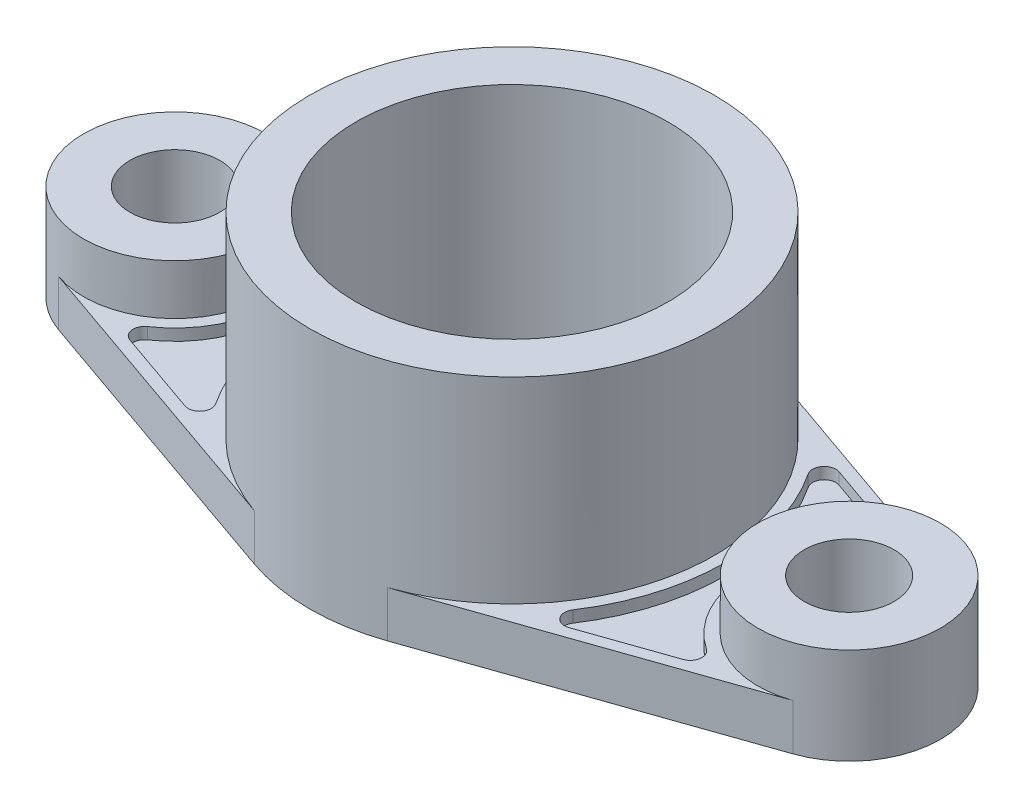
ISO-10303-21;
HEADER;
FILE_DESCRIPTION(('STEP AP214'),'2;1');
FILE_NAME('part.step','',(''),(''),'','','');
FILE_SCHEMA(('AUTOMOTIVE_DESIGN { 1 0 10303 214 1 1 1 1 }'));
ENDSEC;
DATA;
#1=APPLICATION_CONTEXT('core data for automotive mechanical design processes');
#2=APPLICATION_PROTOCOL_DEFINITION('international standard','automotive_design',2000,#1);
#3=PRODUCT_CONTEXT('',#1,'mechanical');
#4=PRODUCT('Part','Part','',(#3));
#5=PRODUCT_RELATED_PRODUCT_CATEGORY('part','',(#4));
#6=PRODUCT_DEFINITION_FORMATION('','',#4);
#7=PRODUCT_DEFINITION_CONTEXT('part definition',#1,'design');
#8=PRODUCT_DEFINITION('design','',#6,#7);
#9=PRODUCT_DEFINITION_SHAPE('','',#8);
#10=(LENGTH_UNIT() NAMED_UNIT(*) SI_UNIT(.MILLI.,.METRE.));
#11=(NAMED_UNIT(*) PLANE_ANGLE_UNIT() SI_UNIT($,.RADIAN.));
#12=(NAMED_UNIT(*) SI_UNIT($,.STERADIAN.) SOLID_ANGLE_UNIT());
#13=UNCERTAINTY_MEASURE_WITH_UNIT(LENGTH_MEASURE(1.E-05),#10,'distance_accuracy_value','');
#14=(GEOMETRIC_REPRESENTATION_CONTEXT(3) GLOBAL_UNCERTAINTY_ASSIGNED_CONTEXT((#13)) GLOBAL_UNIT_ASSIGNED_CONTEXT((#10,
#11,#12)) REPRESENTATION_CONTEXT('',''));
#15=CARTESIAN_POINT('',(0.,0.,0.));
#16=DIRECTION('',(0.,0.,1.));
#17=DIRECTION('',(1.,0.,0.));
#18=AXIS2_PLACEMENT_3D('',#15,#16,#17);
#19=CARTESIAN_POINT('',(16.3123714285714,12.,46.734960558198));
#20=DIRECTION('',(-0.329542857142857,0.,-0.944140617337334));
#21=DIRECTION('',(-0.944140617337334,0.,0.329542857142857));
#22=AXIS2_PLACEMENT_3D('',#19,#20,#21);
#23=PLANE('',#22);
#24=DIRECTION('',(0.944140617337334,0.,-0.329542857142857));
#25=VECTOR('',#24,1.);
#26=CARTESIAN_POINT('',(16.3123714285714,9.,46.734960558198));
#27=LINE('',#26,#25);
#28=CARTESIAN_POINT('',(49.826038740367,9.,35.0373495493516));
#29=VERTEX_POINT('',#28);
#30=CARTESIAN_POINT('',(71.8093276206941,9.,27.3643020244494));
#31=VERTEX_POINT('',#30);
#32=EDGE_CURVE('E355',#29,#31,#27,.T.);
#33=ORIENTED_EDGE('',*,*,#32,.F.);
#34=DIRECTION('',(0.,-1.,0.));
#35=VECTOR('',#34,1.);
#36=CARTESIAN_POINT('',(49.826038740367,12.,35.0373495493516));
#37=LINE('',#36,#35);
#38=CARTESIAN_POINT('',(49.826038740367,12.,35.0373495493516));
#39=VERTEX_POINT('',#38);
#40=EDGE_CURVE('E11',#39,#29,#37,.T.);
#41=ORIENTED_EDGE('',*,*,#40,.F.);
#42=DIRECTION('',(0.944140617337334,0.,-0.329542857142857));
#43=VECTOR('',#42,1.);
#44=CARTESIAN_POINT('',(16.3123714285714,12.,46.734960558198));
#45=LINE('',#44,#43);
#46=CARTESIAN_POINT('',(71.8093276206941,12.,27.3643020244494));
#47=VERTEX_POINT('',#46);
#48=EDGE_CURVE('E396',#39,#47,#45,.T.);
#49=ORIENTED_EDGE('',*,*,#48,.T.);
#50=DIRECTION('',(0.,-1.,0.));
#51=VECTOR('',#50,1.);
#52=CARTESIAN_POINT('',(71.8093276206941,12.,27.3643020244494));
#53=LINE('',#52,#51);
#54=EDGE_CURVE('E433',#47,#31,#53,.T.);
#55=ORIENTED_EDGE('',*,*,#54,.T.);
#56=EDGE_LOOP('',(#33,#41,#49,#55));
#57=FACE_BOUND('',#56,.T.);
#58=ADVANCED_FACE('F45',(#57),#23,.T.);
#59=CARTESIAN_POINT('',(48.8374101689384,12.,32.2049276973396));
#60=DIRECTION('',(0.,-1.,0.));
#61=DIRECTION('',(0.,0.,-1.));
#62=AXIS2_PLACEMENT_3D('',#59,#60,#61);
#63=CYLINDRICAL_SURFACE('',#62,3.);
#64=ORIENTED_EDGE('',*,*,#40,.T.);
#65=CARTESIAN_POINT('',(48.8374101689384,9.,32.2049276973396));
#66=DIRECTION('',(0.,1.,0.));
#67=DIRECTION('',(0.,0.,1.));
#68=AXIS2_PLACEMENT_3D('',#65,#66,#67);
#69=CIRCLE('',#68,3.);
#70=CARTESIAN_POINT('',(46.3329275961724,9.,30.5533929436299));
#71=VERTEX_POINT('',#70);
#72=EDGE_CURVE('E346',#29,#71,#69,.F.);
#73=ORIENTED_EDGE('',*,*,#72,.T.);
#74=DIRECTION('',(0.,-1.,0.));
#75=VECTOR('',#74,1.);
#76=CARTESIAN_POINT('',(46.3329275961724,12.,30.5533929436299));
#77=LINE('',#76,#75);
#78=CARTESIAN_POINT('',(46.3329275961724,12.,30.5533929436299));
#79=VERTEX_POINT('',#78);
#80=EDGE_CURVE('E55',#79,#71,#77,.T.);
#81=ORIENTED_EDGE('',*,*,#80,.F.);
#82=CARTESIAN_POINT('',(48.8374101689384,12.,32.2049276973396));
#83=DIRECTION('',(0.,1.,0.));
#84=DIRECTION('',(0.,0.,1.));
#85=AXIS2_PLACEMENT_3D('',#82,#83,#84);
#86=CIRCLE('',#85,3.);
#87=EDGE_CURVE('E400',#39,#79,#86,.F.);
#88=ORIENTED_EDGE('',*,*,#87,.F.);
#89=EDGE_LOOP('',(#64,#73,#81,#88));
#90=FACE_BOUND('',#89,.T.);
#91=ADVANCED_FACE('F582',(#90),#63,.F.);
#92=CARTESIAN_POINT('',(0.,12.,0.));
#93=DIRECTION('',(0.,-1.,0.));
#94=DIRECTION('',(0.,0.,-1.));
#95=AXIS2_PLACEMENT_3D('',#92,#93,#94);
#96=CYLINDRICAL_SURFACE('',#95,55.5);
#97=ORIENTED_EDGE('',*,*,#80,.T.);
#98=CARTESIAN_POINT('',(0.,9.,0.));
#99=DIRECTION('',(0.,1.,0.));
#100=DIRECTION('',(0.,0.,1.));
#101=AXIS2_PLACEMENT_3D('',#98,#99,#100);
#102=CIRCLE('',#101,55.5);
#103=CARTESIAN_POINT('',(46.3329275961724,9.,-30.5533929436299));
#104=VERTEX_POINT('',#103);
#105=EDGE_CURVE('E377',#71,#104,#102,.T.);
#106=ORIENTED_EDGE('',*,*,#105,.T.);
#107=DIRECTION('',(0.,-1.,0.));
#108=VECTOR('',#107,1.);
#109=CARTESIAN_POINT('',(46.3329275961724,12.,-30.5533929436299));
#110=LINE('',#109,#108);
#111=CARTESIAN_POINT('',(46.3329275961724,12.,-30.5533929436299));
#112=VERTEX_POINT('',#111);
#113=EDGE_CURVE('E452',#112,#104,#110,.T.);
#114=ORIENTED_EDGE('',*,*,#113,.F.);
#115=CARTESIAN_POINT('',(0.,12.,0.));
#116=DIRECTION('',(0.,1.,0.));
#117=DIRECTION('',(0.,0.,1.));
#118=AXIS2_PLACEMENT_3D('',#115,#116,#117);
#119=CIRCLE('',#118,55.5);
#120=EDGE_CURVE('E404',#79,#112,#119,.T.);
#121=ORIENTED_EDGE('',*,*,#120,.F.);
#122=EDGE_LOOP('',(#97,#106,#114,#121));
#123=FACE_BOUND('',#122,.T.);
#124=ADVANCED_FACE('F588',(#123),#96,.T.);
#125=CARTESIAN_POINT('',(48.8374101689384,12.,-32.2049276973396));
#126=DIRECTION('',(0.,-1.,0.));
#127=DIRECTION('',(0.,0.,-1.));
#128=AXIS2_PLACEMENT_3D('',#125,#126,#127);
#129=CYLINDRICAL_SURFACE('',#128,3.);
#130=ORIENTED_EDGE('',*,*,#113,.T.);
#131=CARTESIAN_POINT('',(48.8374101689384,9.,-32.2049276973396));
#132=DIRECTION('',(0.,1.,0.));
#133=DIRECTION('',(0.,0.,1.));
#134=AXIS2_PLACEMENT_3D('',#131,#132,#133);
#135=CIRCLE('',#134,3.);
#136=CARTESIAN_POINT('',(49.826038740367,9.,-35.0373495493516));
#137=VERTEX_POINT('',#136);
#138=EDGE_CURVE('E374',#104,#137,#135,.F.);
#139=ORIENTED_EDGE('',*,*,#138,.T.);
#140=DIRECTION('',(0.,-1.,0.));
#141=VECTOR('',#140,1.);
#142=CARTESIAN_POINT('',(49.826038740367,12.,-35.0373495493516));
#143=LINE('',#142,#141);
#144=CARTESIAN_POINT('',(49.826038740367,12.,-35.0373495493516));
#145=VERTEX_POINT('',#144);
#146=EDGE_CURVE('E448',#145,#137,#143,.T.);
#147=ORIENTED_EDGE('',*,*,#146,.F.);
#148=CARTESIAN_POINT('',(48.8374101689384,12.,-32.2049276973396));
#149=DIRECTION('',(0.,1.,0.));
#150=DIRECTION('',(0.,0.,1.));
#151=AXIS2_PLACEMENT_3D('',#148,#149,#150);
#152=CIRCLE('',#151,3.);
#153=EDGE_CURVE('E408',#112,#145,#152,.F.);
#154=ORIENTED_EDGE('',*,*,#153,.F.);
#155=EDGE_LOOP('',(#130,#139,#147,#154));
#156=FACE_BOUND('',#155,.T.);
#157=ADVANCED_FACE('F911',(#156),#129,.F.);
#158=CARTESIAN_POINT('',(16.3123714285715,12.,-46.7349605581981));
#159=DIRECTION('',(0.329542857142858,0.,-0.944140617337334));
#160=DIRECTION('',(-0.944140617337334,0.,-0.329542857142858));
#161=AXIS2_PLACEMENT_3D('',#158,#159,#160);
#162=PLANE('',#161);
#163=ORIENTED_EDGE('',*,*,#146,.T.);
#164=DIRECTION('',(0.944140617337334,0.,0.329542857142858));
#165=VECTOR('',#164,1.);
#166=CARTESIAN_POINT('',(16.3123714285715,9.,-46.7349605581981));
#167=LINE('',#166,#165);
#168=CARTESIAN_POINT('',(71.8093276206941,9.,-27.3643020244494));
#169=VERTEX_POINT('',#168);
#170=EDGE_CURVE('E371',#137,#169,#167,.T.);
#171=ORIENTED_EDGE('',*,*,#170,.T.);
#172=DIRECTION('',(0.,-1.,0.));
#173=VECTOR('',#172,1.);
#174=CARTESIAN_POINT('',(71.8093276206941,12.,-27.3643020244494));
#175=LINE('',#174,#173);
#176=CARTESIAN_POINT('',(71.8093276206941,12.,-27.3643020244494));
#177=VERTEX_POINT('',#176);
#178=EDGE_CURVE('E444',#177,#169,#175,.T.);
#179=ORIENTED_EDGE('',*,*,#178,.F.);
#180=DIRECTION('',(0.944140617337334,0.,0.329542857142858));
#181=VECTOR('',#180,1.);
#182=CARTESIAN_POINT('',(16.3123714285715,12.,-46.7349605581981));
#183=LINE('',#182,#181);
#184=EDGE_CURVE('E412',#145,#177,#183,.T.);
#185=ORIENTED_EDGE('',*,*,#184,.F.);
#186=EDGE_LOOP('',(#163,#171,#179,#185));
#187=FACE_BOUND('',#186,.T.);
#188=ADVANCED_FACE('F900',(#187),#162,.F.);
#189=CARTESIAN_POINT('',(70.8206990492656,12.,-24.5318801724374));
#190=DIRECTION('',(0.,-1.,0.));
#191=DIRECTION('',(0.,0.,-1.));
#192=AXIS2_PLACEMENT_3D('',#189,#190,#191);
#193=CYLINDRICAL_SURFACE('',#192,3.);
#194=CARTESIAN_POINT('',(70.8206990492656,9.,-24.5318801724374));
#195=DIRECTION('',(0.,1.,0.));
#196=DIRECTION('',(0.,0.,1.));
#197=AXIS2_PLACEMENT_3D('',#194,#195,#196);
#198=CIRCLE('',#197,3.);
#199=CARTESIAN_POINT('',(72.507464694039,9.,-22.0509888689717));
#200=VERTEX_POINT('',#199);
#201=EDGE_CURVE('E367',#200,#169,#198,.T.);
#202=ORIENTED_EDGE('',*,*,#201,.F.);
#203=DIRECTION('',(0.,-1.,0.));
#204=VECTOR('',#203,1.);
#205=CARTESIAN_POINT('',(72.507464694039,12.,-22.0509888689717));
#206=LINE('',#205,#204);
#207=CARTESIAN_POINT('',(72.507464694039,12.,-22.0509888689717));
#208=VERTEX_POINT('',#207);
#209=EDGE_CURVE('E440',#208,#200,#206,.T.);
#210=ORIENTED_EDGE('',*,*,#209,.F.);
#211=CARTESIAN_POINT('',(70.8206990492656,12.,-24.5318801724374));
#212=DIRECTION('',(0.,1.,0.));
#213=DIRECTION('',(0.,0.,1.));
#214=AXIS2_PLACEMENT_3D('',#211,#212,#213);
#215=CIRCLE('',#214,3.);
#216=EDGE_CURVE('E415',#208,#177,#215,.T.);
#217=ORIENTED_EDGE('',*,*,#216,.T.);
#218=ORIENTED_EDGE('',*,*,#178,.T.);
#219=EDGE_LOOP('',(#202,#210,#217,#218));
#220=FACE_BOUND('',#219,.T.);
#221=ADVANCED_FACE('F888',(#220),#193,.F.);
#222=CARTESIAN_POINT('',(87.5,12.,0.));
#223=DIRECTION('',(0.,-1.,0.));
#224=DIRECTION('',(0.,0.,-1.));
#225=AXIS2_PLACEMENT_3D('',#222,#223,#224);
#226=CYLINDRICAL_SURFACE('',#225,26.665);
#227=ORIENTED_EDGE('',*,*,#209,.T.);
#228=CARTESIAN_POINT('',(87.5,9.,0.));
#229=DIRECTION('',(0.,1.,0.));
#230=DIRECTION('',(0.,0.,1.));
#231=AXIS2_PLACEMENT_3D('',#228,#229,#230);
#232=CIRCLE('',#231,26.665);
#233=CARTESIAN_POINT('',(72.507464694039,9.,22.0509888689717));
#234=VERTEX_POINT('',#233);
#235=EDGE_CURVE('E363',#200,#234,#232,.T.);
#236=ORIENTED_EDGE('',*,*,#235,.T.);
#237=DIRECTION('',(0.,-1.,0.));
#238=VECTOR('',#237,1.);
#239=CARTESIAN_POINT('',(72.507464694039,12.,22.0509888689717));
#240=LINE('',#239,#238);
#241=CARTESIAN_POINT('',(72.507464694039,12.,22.0509888689717));
#242=VERTEX_POINT('',#241);
#243=EDGE_CURVE('E437',#242,#234,#240,.T.);
#244=ORIENTED_EDGE('',*,*,#243,.F.);
#245=CARTESIAN_POINT('',(87.5,12.,0.));
#246=DIRECTION('',(0.,1.,0.));
#247=DIRECTION('',(0.,0.,1.));
#248=AXIS2_PLACEMENT_3D('',#245,#246,#247);
#249=CIRCLE('',#248,26.665);
#250=EDGE_CURVE('E419',#208,#242,#249,.T.);
#251=ORIENTED_EDGE('',*,*,#250,.F.);
#252=EDGE_LOOP('',(#227,#236,#244,#251));
#253=FACE_BOUND('',#252,.T.);
#254=ADVANCED_FACE('F603',(#253),#226,.T.);
#255=CARTESIAN_POINT('',(17.301,12.,-49.56738241021));
#256=DIRECTION('',(0.329542857142857,0.,-0.944140617337334));
#257=DIRECTION('',(-0.944140617337334,0.,-0.329542857142857));
#258=AXIS2_PLACEMENT_3D('',#255,#256,#257);
#259=PLANE('',#258);
#260=DIRECTION('',(0.944140617337334,0.,0.329542857142857));
#261=VECTOR('',#260,1.);
#262=CARTESIAN_POINT('',(17.301,0.,-49.56738241021));
#263=LINE('',#262,#261);
#264=CARTESIAN_POINT('',(17.301,0.,-49.56738241021));
#265=VERTEX_POINT('',#264);
#266=CARTESIAN_POINT('',(95.2986317142857,0.,-22.343087709288));
#267=VERTEX_POINT('',#266);
#268=EDGE_CURVE('E380',#265,#267,#263,.T.);
#269=ORIENTED_EDGE('',*,*,#268,.F.);
#270=DIRECTION('',(0.,-1.,0.));
#271=VECTOR('',#270,1.);
#272=CARTESIAN_POINT('',(17.301,12.,-49.56738241021));
#273=LINE('',#272,#271);
#274=CARTESIAN_POINT('',(17.301,12.,-49.56738241021));
#275=VERTEX_POINT('',#274);
#276=EDGE_CURVE('E465',#275,#265,#273,.T.);
#277=ORIENTED_EDGE('',*,*,#276,.F.);
#278=DIRECTION('',(0.944140617337334,0.,0.329542857142857));
#279=VECTOR('',#278,1.);
#280=CARTESIAN_POINT('',(17.301,12.,-49.56738241021));
#281=LINE('',#280,#279);
#282=CARTESIAN_POINT('',(95.2986317142857,12.,-22.343087709288));
#283=VERTEX_POINT('',#282);
#284=EDGE_CURVE('E384',#275,#283,#281,.T.);
#285=ORIENTED_EDGE('',*,*,#284,.T.);
#286=DIRECTION('',(0.,-1.,0.));
#287=VECTOR('',#286,1.);
#288=CARTESIAN_POINT('',(95.2986317142857,12.,-22.343087709288));
#289=LINE('',#288,#287);
#290=EDGE_CURVE('E49',#283,#267,#289,.T.);
#291=ORIENTED_EDGE('',*,*,#290,.T.);
#292=EDGE_LOOP('',(#269,#277,#285,#291));
#293=FACE_BOUND('',#292,.T.);
#294=ADVANCED_FACE('F47',(#293),#259,.T.);
#295=CARTESIAN_POINT('',(17.301,12.,49.5673824102101));
#296=DIRECTION('',(0.329542857142857,0.,0.944140617337334));
#297=DIRECTION('',(0.944140617337334,0.,-0.329542857142857));
#298=AXIS2_PLACEMENT_3D('',#295,#296,#297);
#299=PLANE('',#298);
#300=DIRECTION('',(-0.944140617337334,0.,0.329542857142857));
#301=VECTOR('',#300,1.);
#302=CARTESIAN_POINT('',(17.301,0.,49.5673824102101));
#303=LINE('',#302,#301);
#304=CARTESIAN_POINT('',(95.2986317142857,0.,22.343087709288));
#305=VERTEX_POINT('',#304);
#306=CARTESIAN_POINT('',(17.301,0.,49.56738241021));
#307=VERTEX_POINT('',#306);
#308=EDGE_CURVE('E385',#305,#307,#303,.T.);
#309=ORIENTED_EDGE('',*,*,#308,.F.);
#310=DIRECTION('',(0.,-1.,0.));
#311=VECTOR('',#310,1.);
#312=CARTESIAN_POINT('',(95.2986317142857,12.,22.343087709288));
#313=LINE('',#312,#311);
#314=CARTESIAN_POINT('',(95.2986317142857,12.,22.343087709288));
#315=VERTEX_POINT('',#314);
#316=EDGE_CURVE('E426',#315,#305,#313,.T.);
#317=ORIENTED_EDGE('',*,*,#316,.F.);
#318=DIRECTION('',(-0.944140617337334,0.,0.329542857142857));
#319=VECTOR('',#318,1.);
#320=CARTESIAN_POINT('',(17.301,12.,49.5673824102101));
#321=LINE('',#320,#319);
#322=CARTESIAN_POINT('',(17.301,12.,49.56738241021));
#323=VERTEX_POINT('',#322);
#324=EDGE_CURVE('E392',#315,#323,#321,.T.);
#325=ORIENTED_EDGE('',*,*,#324,.T.);
#326=DIRECTION('',(0.,-1.,0.));
#327=VECTOR('',#326,1.);
#328=CARTESIAN_POINT('',(17.301,12.,49.5673824102101));
#329=LINE('',#328,#327);
#330=EDGE_CURVE('E462',#323,#307,#329,.T.);
#331=ORIENTED_EDGE('',*,*,#330,.T.);
#332=EDGE_LOOP('',(#309,#317,#325,#331));
#333=FACE_BOUND('',#332,.T.);
#334=ADVANCED_FACE('F592',(#333),#299,.T.);
#335=CARTESIAN_POINT('',(70.8206990492656,12.,24.5318801724374));
#336=DIRECTION('',(0.,-1.,0.));
#337=DIRECTION('',(0.,0.,-1.));
#338=AXIS2_PLACEMENT_3D('',#335,#336,#337);
#339=CYLINDRICAL_SURFACE('',#338,3.);
#340=CARTESIAN_POINT('',(70.8206990492656,9.,24.5318801724374));
#341=DIRECTION('',(0.,1.,0.));
#342=DIRECTION('',(0.,0.,1.));
#343=AXIS2_PLACEMENT_3D('',#340,#341,#342);
#344=CIRCLE('',#343,3.);
#345=EDGE_CURVE('E359',#31,#234,#344,.T.);
#346=ORIENTED_EDGE('',*,*,#345,.F.);
#347=ORIENTED_EDGE('',*,*,#54,.F.);
#348=CARTESIAN_POINT('',(70.8206990492656,12.,24.5318801724374));
#349=DIRECTION('',(0.,1.,0.));
#350=DIRECTION('',(0.,0.,1.));
#351=AXIS2_PLACEMENT_3D('',#348,#349,#350);
#352=CIRCLE('',#351,3.);
#353=EDGE_CURVE('E422',#47,#242,#352,.T.);
#354=ORIENTED_EDGE('',*,*,#353,.T.);
#355=ORIENTED_EDGE('',*,*,#243,.T.);
#356=EDGE_LOOP('',(#346,#347,#354,#355));
#357=FACE_BOUND('',#356,.T.);
#358=ADVANCED_FACE('F594',(#357),#339,.F.);
#359=CARTESIAN_POINT('',(0.,12.,0.));
#360=DIRECTION('',(0.,1.,0.));
#361=DIRECTION('',(0.,0.,1.));
#362=AXIS2_PLACEMENT_3D('',#359,#360,#361);
#363=PLANE('',#362);
#364=CARTESIAN_POINT('',(87.5,12.,0.));
#365=DIRECTION('',(0.,1.,0.));
#366=DIRECTION('',(0.,0.,1.));
#367=AXIS2_PLACEMENT_3D('',#364,#365,#366);
#368=CIRCLE('',#367,23.665);
#369=EDGE_CURVE('E381',#283,#315,#368,.T.);
#370=ORIENTED_EDGE('',*,*,#369,.F.);
#371=ORIENTED_EDGE('',*,*,#284,.F.);
#372=CARTESIAN_POINT('',(0.,12.,0.));
#373=DIRECTION('',(0.,1.,0.));
#374=DIRECTION('',(0.,0.,1.));
#375=AXIS2_PLACEMENT_3D('',#372,#373,#374);
#376=CIRCLE('',#375,52.5);
#377=EDGE_CURVE('E389',#323,#275,#376,.T.);
#378=ORIENTED_EDGE('',*,*,#377,.F.);
#379=ORIENTED_EDGE('',*,*,#324,.F.);
#380=EDGE_LOOP('',(#370,#371,#378,#379));
#381=FACE_BOUND('',#380,.T.);
#382=ORIENTED_EDGE('',*,*,#48,.F.);
#383=ORIENTED_EDGE('',*,*,#87,.T.);
#384=ORIENTED_EDGE('',*,*,#120,.T.);
#385=ORIENTED_EDGE('',*,*,#153,.T.);
#386=ORIENTED_EDGE('',*,*,#184,.T.);
#387=ORIENTED_EDGE('',*,*,#216,.F.);
#388=ORIENTED_EDGE('',*,*,#250,.T.);
#389=ORIENTED_EDGE('',*,*,#353,.F.);
#390=EDGE_LOOP('',(#382,#383,#384,#385,#386,#387,#388,#389));
#391=FACE_BOUND('',#390,.T.);
#392=ADVANCED_FACE('F600',(#381,#391),#363,.T.);
#393=CARTESIAN_POINT('',(0.,0.,0.));
#394=DIRECTION('',(0.,1.,0.));
#395=DIRECTION('',(0.,0.,1.));
#396=AXIS2_PLACEMENT_3D('',#393,#394,#395);
#397=PLANE('',#396);
#398=ORIENTED_EDGE('',*,*,#268,.T.);
#399=CARTESIAN_POINT('',(87.5,0.,0.));
#400=DIRECTION('',(0.,1.,0.));
#401=DIRECTION('',(0.,0.,1.));
#402=AXIS2_PLACEMENT_3D('',#399,#400,#401);
#403=CIRCLE('',#402,23.665);
#404=EDGE_CURVE('E479',#305,#267,#403,.T.);
#405=ORIENTED_EDGE('',*,*,#404,.F.);
#406=ORIENTED_EDGE('',*,*,#308,.T.);
#407=CARTESIAN_POINT('',(0.,0.,0.));
#408=DIRECTION('',(0.,1.,0.));
#409=DIRECTION('',(0.,0.,1.));
#410=AXIS2_PLACEMENT_3D('',#407,#408,#409);
#411=CIRCLE('',#410,52.5);
#412=CARTESIAN_POINT('',(-17.301,0.,49.5673824102101));
#413=VERTEX_POINT('',#412);
#414=EDGE_CURVE('E350',#413,#307,#411,.T.);
#415=ORIENTED_EDGE('',*,*,#414,.F.);
#416=DIRECTION('',(0.944140617337334,0.,0.329542857142857));
#417=VECTOR('',#416,1.);
#418=CARTESIAN_POINT('',(-17.301,0.,49.5673824102101));
#419=LINE('',#418,#417);
#420=CARTESIAN_POINT('',(-95.2986317142857,0.,22.343087709288));
#421=VERTEX_POINT('',#420);
#422=EDGE_CURVE('E256',#421,#413,#419,.T.);
#423=ORIENTED_EDGE('',*,*,#422,.F.);
#424=CARTESIAN_POINT('',(-87.5,0.,0.));
#425=DIRECTION('',(0.,1.,0.));
#426=DIRECTION('',(0.,0.,1.));
#427=AXIS2_PLACEMENT_3D('',#424,#425,#426);
#428=CIRCLE('',#427,23.665);
#429=CARTESIAN_POINT('',(-95.2986317142857,0.,-22.343087709288));
#430=VERTEX_POINT('',#429);
#431=EDGE_CURVE('E486',#430,#421,#428,.T.);
#432=ORIENTED_EDGE('',*,*,#431,.F.);
#433=DIRECTION('',(0.944140617337334,0.,-0.329542857142857));
#434=VECTOR('',#433,1.);
#435=CARTESIAN_POINT('',(-17.301,0.,-49.5673824102101));
#436=LINE('',#435,#434);
#437=CARTESIAN_POINT('',(-37.6097890840281,0.,-42.4788023227049));
#438=VERTEX_POINT('',#437);
#439=EDGE_CURVE('E231',#430,#438,#436,.T.);
#440=ORIENTED_EDGE('',*,*,#439,.T.);
#441=DIRECTION('',(0.944243067639777,0.,-0.329249190149686));
#442=VECTOR('',#441,1.);
#443=CARTESIAN_POINT('',(-17.2833788879848,0.,-49.5664414328611));
#444=LINE('',#443,#442);
#445=CARTESIAN_POINT('',(-18.0749102588401,0.,-49.290441458105));
#446=VERTEX_POINT('',#445);
#447=EDGE_CURVE('E260',#438,#446,#444,.T.);
#448=ORIENTED_EDGE('',*,*,#447,.T.);
#449=EDGE_CURVE('E342',#265,#446,#411,.T.);
#450=ORIENTED_EDGE('',*,*,#449,.F.);
#451=EDGE_LOOP('',(#398,#405,#406,#415,#423,#432,#440,#448,#450));
#452=FACE_BOUND('',#451,.T.);
#453=CARTESIAN_POINT('',(0.,0.,0.));
#454=DIRECTION('',(0.,1.,0.));
#455=DIRECTION('',(0.,0.,1.));
#456=AXIS2_PLACEMENT_3D('',#453,#454,#455);
#457=CIRCLE('',#456,40.5);
#458=CARTESIAN_POINT('',(0.,0.,40.5));
#459=VERTEX_POINT('',#458);
#460=EDGE_CURVE('E336',#459,#459,#457,.T.);
#461=ORIENTED_EDGE('',*,*,#460,.T.);
#462=EDGE_LOOP('',(#461));
#463=FACE_BOUND('',#462,.T.);
#464=CARTESIAN_POINT('',(87.5,0.,0.));
#465=DIRECTION('',(0.,1.,0.));
#466=DIRECTION('',(0.,0.,1.));
#467=AXIS2_PLACEMENT_3D('',#464,#465,#466);
#468=CIRCLE('',#467,11.665);
#469=CARTESIAN_POINT('',(87.5,0.,11.665));
#470=VERTEX_POINT('',#469);
#471=EDGE_CURVE('E507',#470,#470,#468,.T.);
#472=ORIENTED_EDGE('',*,*,#471,.T.);
#473=EDGE_LOOP('',(#472));
#474=FACE_BOUND('',#473,.T.);
#475=CARTESIAN_POINT('',(-87.5,0.,0.));
#476=DIRECTION('',(0.,1.,0.));
#477=DIRECTION('',(0.,0.,1.));
#478=AXIS2_PLACEMENT_3D('',#475,#476,#477);
#479=CIRCLE('',#478,11.665);
#480=CARTESIAN_POINT('',(-87.5,0.,11.665));
#481=VERTEX_POINT('',#480);
#482=EDGE_CURVE('E489',#481,#481,#479,.T.);
#483=ORIENTED_EDGE('',*,*,#482,.T.);
#484=EDGE_LOOP('',(#483));
#485=FACE_BOUND('',#484,.T.);
#486=ADVANCED_FACE('F477',(#452,#463,#474,#485),#397,.F.);
#487=CARTESIAN_POINT('',(0.,9.,0.));
#488=DIRECTION('',(0.,1.,0.));
#489=DIRECTION('',(0.,0.,1.));
#490=AXIS2_PLACEMENT_3D('',#487,#488,#489);
#491=PLANE('',#490);
#492=ORIENTED_EDGE('',*,*,#72,.F.);
#493=ORIENTED_EDGE('',*,*,#32,.T.);
#494=ORIENTED_EDGE('',*,*,#345,.T.);
#495=ORIENTED_EDGE('',*,*,#235,.F.);
#496=ORIENTED_EDGE('',*,*,#201,.T.);
#497=ORIENTED_EDGE('',*,*,#170,.F.);
#498=ORIENTED_EDGE('',*,*,#138,.F.);
#499=ORIENTED_EDGE('',*,*,#105,.F.);
#500=EDGE_LOOP('',(#492,#493,#494,#495,#496,#497,#498,#499));
#501=FACE_BOUND('',#500,.T.);
#502=ADVANCED_FACE('F772',(#501),#491,.T.);
#503=CARTESIAN_POINT('',(0.,63.,0.));
#504=DIRECTION('',(0.,-1.,0.));
#505=DIRECTION('',(0.,0.,-1.));
#506=AXIS2_PLACEMENT_3D('',#503,#504,#505);
#507=CYLINDRICAL_SURFACE('',#506,40.5);
#508=CARTESIAN_POINT('',(0.,63.,0.));
#509=DIRECTION('',(0.,1.,0.));
#510=DIRECTION('',(0.,0.,1.));
#511=AXIS2_PLACEMENT_3D('',#508,#509,#510);
#512=CIRCLE('',#511,40.5);
#513=CARTESIAN_POINT('',(0.,63.,40.5));
#514=VERTEX_POINT('',#513);
#515=EDGE_CURVE('E337',#514,#514,#512,.T.);
#516=ORIENTED_EDGE('',*,*,#515,.T.);
#517=EDGE_LOOP('',(#516));
#518=FACE_BOUND('',#517,.T.);
#519=ORIENTED_EDGE('',*,*,#460,.F.);
#520=EDGE_LOOP('',(#519));
#521=FACE_BOUND('',#520,.T.);
#522=ADVANCED_FACE('F764',(#518,#521),#507,.F.);
#523=CARTESIAN_POINT('',(0.,63.,0.));
#524=DIRECTION('',(0.,-1.,0.));
#525=DIRECTION('',(0.,0.,-1.));
#526=AXIS2_PLACEMENT_3D('',#523,#524,#525);
#527=CYLINDRICAL_SURFACE('',#526,52.5);
#528=CARTESIAN_POINT('',(0.,12.,0.));
#529=DIRECTION('',(0.,1.,0.));
#530=DIRECTION('',(0.,0.,1.));
#531=AXIS2_PLACEMENT_3D('',#528,#529,#530);
#532=CIRCLE('',#531,52.5);
#533=CARTESIAN_POINT('',(-18.0749102588399,12.,-49.2904414581051));
#534=VERTEX_POINT('',#533);
#535=CARTESIAN_POINT('',(-17.301,12.,49.5673824102101));
#536=VERTEX_POINT('',#535);
#537=EDGE_CURVE('E63',#534,#536,#532,.T.);
#538=ORIENTED_EDGE('',*,*,#537,.T.);
#539=DIRECTION('',(0.,-1.,0.));
#540=VECTOR('',#539,1.);
#541=CARTESIAN_POINT('',(-17.301,12.,49.5673824102101));
#542=LINE('',#541,#540);
#543=EDGE_CURVE('E272',#536,#413,#542,.T.);
#544=ORIENTED_EDGE('',*,*,#543,.T.);
#545=ORIENTED_EDGE('',*,*,#414,.T.);
#546=ORIENTED_EDGE('',*,*,#330,.F.);
#547=ORIENTED_EDGE('',*,*,#377,.T.);
#548=ORIENTED_EDGE('',*,*,#276,.T.);
#549=ORIENTED_EDGE('',*,*,#449,.T.);
#550=DIRECTION('',(0.,-1.,0.));
#551=VECTOR('',#550,1.);
#552=CARTESIAN_POINT('',(-18.0749102588399,12.,-49.2904414581051));
#553=LINE('',#552,#551);
#554=EDGE_CURVE('E68',#534,#446,#553,.T.);
#555=ORIENTED_EDGE('',*,*,#554,.F.);
#556=EDGE_LOOP('',(#538,#544,#545,#546,#547,#548,#549,#555));
#557=FACE_BOUND('',#556,.T.);
#558=CARTESIAN_POINT('',(0.,63.,0.));
#559=DIRECTION('',(0.,1.,0.));
#560=DIRECTION('',(0.,0.,1.));
#561=AXIS2_PLACEMENT_3D('',#558,#559,#560);
#562=CIRCLE('',#561,52.5);
#563=CARTESIAN_POINT('',(0.,63.,52.5));
#564=VERTEX_POINT('',#563);
#565=EDGE_CURVE('E341',#564,#564,#562,.T.);
#566=ORIENTED_EDGE('',*,*,#565,.F.);
#567=EDGE_LOOP('',(#566));
#568=FACE_BOUND('',#567,.T.);
#569=ADVANCED_FACE('F481',(#557,#568),#527,.T.);
#570=CARTESIAN_POINT('',(0.,63.,0.));
#571=DIRECTION('',(0.,1.,0.));
#572=DIRECTION('',(0.,0.,1.));
#573=AXIS2_PLACEMENT_3D('',#570,#571,#572);
#574=PLANE('',#573);
#575=ORIENTED_EDGE('',*,*,#515,.F.);
#576=EDGE_LOOP('',(#575));
#577=FACE_BOUND('',#576,.T.);
#578=ORIENTED_EDGE('',*,*,#565,.T.);
#579=EDGE_LOOP('',(#578));
#580=FACE_BOUND('',#579,.T.);
#581=ADVANCED_FACE('F570',(#577,#580),#574,.T.);
#582=CARTESIAN_POINT('',(0.,9.,0.));
#583=DIRECTION('',(0.,1.,0.));
#584=DIRECTION('',(0.,0.,1.));
#585=AXIS2_PLACEMENT_3D('',#582,#583,#584);
#586=PLANE('',#585);
#587=CARTESIAN_POINT('',(0.,9.,0.));
#588=DIRECTION('',(0.,1.,0.));
#589=DIRECTION('',(0.,0.,1.));
#590=AXIS2_PLACEMENT_3D('',#587,#588,#589);
#591=CIRCLE('',#590,55.5);
#592=CARTESIAN_POINT('',(-46.3329275961723,9.,-30.5533929436299));
#593=VERTEX_POINT('',#592);
#594=CARTESIAN_POINT('',(-46.3329275961724,9.,30.5533929436298));
#595=VERTEX_POINT('',#594);
#596=EDGE_CURVE('E277',#593,#595,#591,.T.);
#597=ORIENTED_EDGE('',*,*,#596,.F.);
#598=CARTESIAN_POINT('',(-48.8374101689384,9.,-32.2049276973396));
#599=DIRECTION('',(0.,1.,0.));
#600=DIRECTION('',(0.,0.,1.));
#601=AXIS2_PLACEMENT_3D('',#598,#599,#600);
#602=CIRCLE('',#601,3.);
#603=CARTESIAN_POINT('',(-49.826038740367,9.,-35.0373495493516));
#604=VERTEX_POINT('',#603);
#605=EDGE_CURVE('E311',#593,#604,#602,.T.);
#606=ORIENTED_EDGE('',*,*,#605,.T.);
#607=DIRECTION('',(0.944140617337334,0.,-0.329542857142857));
#608=VECTOR('',#607,1.);
#609=CARTESIAN_POINT('',(-16.3123714285714,9.,-46.734960558198));
#610=LINE('',#609,#608);
#611=CARTESIAN_POINT('',(-71.8093276206941,9.,-27.3643020244494));
#612=VERTEX_POINT('',#611);
#613=EDGE_CURVE('E314',#612,#604,#610,.T.);
#614=ORIENTED_EDGE('',*,*,#613,.F.);
#615=CARTESIAN_POINT('',(-70.8206990492656,9.,-24.5318801724374));
#616=DIRECTION('',(0.,1.,0.));
#617=DIRECTION('',(0.,0.,1.));
#618=AXIS2_PLACEMENT_3D('',#615,#616,#617);
#619=CIRCLE('',#618,3.00000000000001);
#620=CARTESIAN_POINT('',(-72.507464694039,9.,-22.0509888689717));
#621=VERTEX_POINT('',#620);
#622=EDGE_CURVE('E318',#621,#612,#619,.F.);
#623=ORIENTED_EDGE('',*,*,#622,.F.);
#624=CARTESIAN_POINT('',(-87.5,9.,0.));
#625=DIRECTION('',(0.,1.,0.));
#626=DIRECTION('',(0.,0.,1.));
#627=AXIS2_PLACEMENT_3D('',#624,#625,#626);
#628=CIRCLE('',#627,26.665);
#629=CARTESIAN_POINT('',(-72.507464694039,9.,22.0509888689717));
#630=VERTEX_POINT('',#629);
#631=EDGE_CURVE('E322',#630,#621,#628,.T.);
#632=ORIENTED_EDGE('',*,*,#631,.F.);
#633=CARTESIAN_POINT('',(-70.8206990492656,9.,24.5318801724374));
#634=DIRECTION('',(0.,1.,0.));
#635=DIRECTION('',(0.,0.,1.));
#636=AXIS2_PLACEMENT_3D('',#633,#634,#635);
#637=CIRCLE('',#636,3.);
#638=CARTESIAN_POINT('',(-71.8093276206941,9.,27.3643020244495));
#639=VERTEX_POINT('',#638);
#640=EDGE_CURVE('E326',#639,#630,#637,.F.);
#641=ORIENTED_EDGE('',*,*,#640,.F.);
#642=DIRECTION('',(0.944140617337334,0.,0.329542857142857));
#643=VECTOR('',#642,1.);
#644=CARTESIAN_POINT('',(-16.3123714285714,9.,46.734960558198));
#645=LINE('',#644,#643);
#646=CARTESIAN_POINT('',(-49.826038740367,9.,35.0373495493516));
#647=VERTEX_POINT('',#646);
#648=EDGE_CURVE('E330',#639,#647,#645,.T.);
#649=ORIENTED_EDGE('',*,*,#648,.T.);
#650=CARTESIAN_POINT('',(-48.8374101689385,9.,32.2049276973396));
#651=DIRECTION('',(0.,1.,0.));
#652=DIRECTION('',(0.,0.,1.));
#653=AXIS2_PLACEMENT_3D('',#650,#651,#652);
#654=CIRCLE('',#653,3.00000000000001);
#655=EDGE_CURVE('E333',#647,#595,#654,.T.);
#656=ORIENTED_EDGE('',*,*,#655,.T.);
#657=EDGE_LOOP('',(#597,#606,#614,#623,#632,#641,#649,#656));
#658=FACE_BOUND('',#657,.T.);
#659=ADVANCED_FACE('F567',(#658),#586,.T.);
#660=CARTESIAN_POINT('',(-17.301,12.,49.5673824102101));
#661=DIRECTION('',(0.329542857142857,0.,-0.944140617337334));
#662=DIRECTION('',(-0.944140617337334,0.,-0.329542857142857));
#663=AXIS2_PLACEMENT_3D('',#660,#661,#662);
#664=PLANE('',#663);
#665=ORIENTED_EDGE('',*,*,#422,.T.);
#666=ORIENTED_EDGE('',*,*,#543,.F.);
#667=DIRECTION('',(0.944140617337334,0.,0.329542857142857));
#668=VECTOR('',#667,1.);
#669=CARTESIAN_POINT('',(-17.301,12.,49.5673824102101));
#670=LINE('',#669,#668);
#671=CARTESIAN_POINT('',(-95.2986317142857,12.,22.343087709288));
#672=VERTEX_POINT('',#671);
#673=EDGE_CURVE('E242',#672,#536,#670,.T.);
#674=ORIENTED_EDGE('',*,*,#673,.F.);
#675=DIRECTION('',(0.,-1.,0.));
#676=VECTOR('',#675,1.);
#677=CARTESIAN_POINT('',(-95.2986317142857,12.,22.343087709288));
#678=LINE('',#677,#676);
#679=EDGE_CURVE('E240',#672,#421,#678,.T.);
#680=ORIENTED_EDGE('',*,*,#679,.T.);
#681=EDGE_LOOP('',(#665,#666,#674,#680));
#682=FACE_BOUND('',#681,.T.);
#683=ADVANCED_FACE('F569',(#682),#664,.F.);
#684=CARTESIAN_POINT('',(-17.2833788879848,12.,-49.5664414328611));
#685=DIRECTION('',(-0.329249190149685,0.,-0.944243067639777));
#686=DIRECTION('',(-0.944243067639777,0.,0.329249190149686));
#687=AXIS2_PLACEMENT_3D('',#684,#685,#686);
#688=PLANE('',#687);
#689=ORIENTED_EDGE('',*,*,#447,.F.);
#690=DIRECTION('',(0.,-1.,0.));
#691=VECTOR('',#690,1.);
#692=CARTESIAN_POINT('',(-37.6097890840281,12.,-42.4788023227049));
#693=LINE('',#692,#691);
#694=CARTESIAN_POINT('',(-37.6097890840281,12.,-42.4788023227049));
#695=VERTEX_POINT('',#694);
#696=EDGE_CURVE('E236',#695,#438,#693,.T.);
#697=ORIENTED_EDGE('',*,*,#696,.F.);
#698=DIRECTION('',(0.944243067639777,0.,-0.329249190149686));
#699=VECTOR('',#698,1.);
#700=CARTESIAN_POINT('',(-17.2833788879848,12.,-49.5664414328611));
#701=LINE('',#700,#699);
#702=EDGE_CURVE('E222',#695,#534,#701,.T.);
#703=ORIENTED_EDGE('',*,*,#702,.T.);
#704=ORIENTED_EDGE('',*,*,#554,.T.);
#705=EDGE_LOOP('',(#689,#697,#703,#704));
#706=FACE_BOUND('',#705,.T.);
#707=ADVANCED_FACE('F484',(#706),#688,.T.);
#708=CARTESIAN_POINT('',(-48.8374101689384,12.,-32.2049276973396));
#709=DIRECTION('',(0.,-1.,0.));
#710=DIRECTION('',(0.,0.,-1.));
#711=AXIS2_PLACEMENT_3D('',#708,#709,#710);
#712=CYLINDRICAL_SURFACE('',#711,3.);
#713=DIRECTION('',(0.,-1.,0.));
#714=VECTOR('',#713,1.);
#715=CARTESIAN_POINT('',(-49.826038740367,12.,-35.0373495493516));
#716=LINE('',#715,#714);
#717=CARTESIAN_POINT('',(-49.826038740367,12.,-35.0373495493516));
#718=VERTEX_POINT('',#717);
#719=EDGE_CURVE('E225',#718,#604,#716,.T.);
#720=ORIENTED_EDGE('',*,*,#719,.T.);
#721=ORIENTED_EDGE('',*,*,#605,.F.);
#722=DIRECTION('',(0.,-1.,0.));
#723=VECTOR('',#722,1.);
#724=CARTESIAN_POINT('',(-46.3329275961723,12.,-30.5533929436299));
#725=LINE('',#724,#723);
#726=CARTESIAN_POINT('',(-46.3329275961723,12.,-30.5533929436299));
#727=VERTEX_POINT('',#726);
#728=EDGE_CURVE('E237',#727,#593,#725,.T.);
#729=ORIENTED_EDGE('',*,*,#728,.F.);
#730=CARTESIAN_POINT('',(-48.8374101689384,12.,-32.2049276973396));
#731=DIRECTION('',(0.,1.,0.));
#732=DIRECTION('',(0.,0.,1.));
#733=AXIS2_PLACEMENT_3D('',#730,#731,#732);
#734=CIRCLE('',#733,3.);
#735=EDGE_CURVE('E266',#727,#718,#734,.T.);
#736=ORIENTED_EDGE('',*,*,#735,.T.);
#737=EDGE_LOOP('',(#720,#721,#729,#736));
#738=FACE_BOUND('',#737,.T.);
#739=ADVANCED_FACE('F547',(#738),#712,.F.);
#740=CARTESIAN_POINT('',(0.,12.,0.));
#741=DIRECTION('',(0.,-1.,0.));
#742=DIRECTION('',(0.,0.,-1.));
#743=AXIS2_PLACEMENT_3D('',#740,#741,#742);
#744=CYLINDRICAL_SURFACE('',#743,55.5);
#745=ORIENTED_EDGE('',*,*,#596,.T.);
#746=DIRECTION('',(0.,-1.,0.));
#747=VECTOR('',#746,1.);
#748=CARTESIAN_POINT('',(-46.3329275961724,12.,30.5533929436298));
#749=LINE('',#748,#747);
#750=CARTESIAN_POINT('',(-46.3329275961724,12.,30.5533929436298));
#751=VERTEX_POINT('',#750);
#752=EDGE_CURVE('E301',#751,#595,#749,.T.);
#753=ORIENTED_EDGE('',*,*,#752,.F.);
#754=CARTESIAN_POINT('',(0.,12.,0.));
#755=DIRECTION('',(0.,1.,0.));
#756=DIRECTION('',(0.,0.,1.));
#757=AXIS2_PLACEMENT_3D('',#754,#755,#756);
#758=CIRCLE('',#757,55.5);
#759=EDGE_CURVE('E516',#727,#751,#758,.T.);
#760=ORIENTED_EDGE('',*,*,#759,.F.);
#761=ORIENTED_EDGE('',*,*,#728,.T.);
#762=EDGE_LOOP('',(#745,#753,#760,#761));
#763=FACE_BOUND('',#762,.T.);
#764=ADVANCED_FACE('F553',(#763),#744,.T.);
#765=CARTESIAN_POINT('',(-48.8374101689385,12.,32.2049276973396));
#766=DIRECTION('',(0.,-1.,0.));
#767=DIRECTION('',(0.,0.,-1.));
#768=AXIS2_PLACEMENT_3D('',#765,#766,#767);
#769=CYLINDRICAL_SURFACE('',#768,3.00000000000001);
#770=ORIENTED_EDGE('',*,*,#752,.T.);
#771=ORIENTED_EDGE('',*,*,#655,.F.);
#772=DIRECTION('',(0.,-1.,0.));
#773=VECTOR('',#772,1.);
#774=CARTESIAN_POINT('',(-49.826038740367,12.,35.0373495493516));
#775=LINE('',#774,#773);
#776=CARTESIAN_POINT('',(-49.826038740367,12.,35.0373495493516));
#777=VERTEX_POINT('',#776);
#778=EDGE_CURVE('E297',#777,#647,#775,.T.);
#779=ORIENTED_EDGE('',*,*,#778,.F.);
#780=CARTESIAN_POINT('',(-48.8374101689385,12.,32.2049276973396));
#781=DIRECTION('',(0.,1.,0.));
#782=DIRECTION('',(0.,0.,1.));
#783=AXIS2_PLACEMENT_3D('',#780,#781,#782);
#784=CIRCLE('',#783,3.00000000000001);
#785=EDGE_CURVE('E519',#777,#751,#784,.T.);
#786=ORIENTED_EDGE('',*,*,#785,.T.);
#787=EDGE_LOOP('',(#770,#771,#779,#786));
#788=FACE_BOUND('',#787,.T.);
#789=ADVANCED_FACE('F556',(#788),#769,.F.);
#790=CARTESIAN_POINT('',(-16.3123714285714,12.,46.734960558198));
#791=DIRECTION('',(0.329542857142857,0.,-0.944140617337334));
#792=DIRECTION('',(-0.944140617337334,0.,-0.329542857142857));
#793=AXIS2_PLACEMENT_3D('',#790,#791,#792);
#794=PLANE('',#793);
#795=ORIENTED_EDGE('',*,*,#778,.T.);
#796=ORIENTED_EDGE('',*,*,#648,.F.);
#797=DIRECTION('',(0.,-1.,0.));
#798=VECTOR('',#797,1.);
#799=CARTESIAN_POINT('',(-71.8093276206941,12.,27.3643020244495));
#800=LINE('',#799,#798);
#801=CARTESIAN_POINT('',(-71.8093276206941,12.,27.3643020244495));
#802=VERTEX_POINT('',#801);
#803=EDGE_CURVE('E293',#802,#639,#800,.T.);
#804=ORIENTED_EDGE('',*,*,#803,.F.);
#805=DIRECTION('',(0.944140617337334,0.,0.329542857142857));
#806=VECTOR('',#805,1.);
#807=CARTESIAN_POINT('',(-16.3123714285714,12.,46.734960558198));
#808=LINE('',#807,#806);
#809=EDGE_CURVE('E523',#802,#777,#808,.T.);
#810=ORIENTED_EDGE('',*,*,#809,.T.);
#811=EDGE_LOOP('',(#795,#796,#804,#810));
#812=FACE_BOUND('',#811,.T.);
#813=ADVANCED_FACE('F559',(#812),#794,.T.);
#814=CARTESIAN_POINT('',(-70.8206990492656,12.,24.5318801724374));
#815=DIRECTION('',(0.,-1.,0.));
#816=DIRECTION('',(0.,0.,-1.));
#817=AXIS2_PLACEMENT_3D('',#814,#815,#816);
#818=CYLINDRICAL_SURFACE('',#817,3.);
#819=ORIENTED_EDGE('',*,*,#640,.T.);
#820=DIRECTION('',(0.,-1.,0.));
#821=VECTOR('',#820,1.);
#822=CARTESIAN_POINT('',(-72.507464694039,12.,22.0509888689717));
#823=LINE('',#822,#821);
#824=CARTESIAN_POINT('',(-72.507464694039,12.,22.0509888689717));
#825=VERTEX_POINT('',#824);
#826=EDGE_CURVE('E289',#825,#630,#823,.T.);
#827=ORIENTED_EDGE('',*,*,#826,.F.);
#828=CARTESIAN_POINT('',(-70.8206990492656,12.,24.5318801724374));
#829=DIRECTION('',(0.,1.,0.));
#830=DIRECTION('',(0.,0.,1.));
#831=AXIS2_PLACEMENT_3D('',#828,#829,#830);
#832=CIRCLE('',#831,3.);
#833=EDGE_CURVE('E527',#802,#825,#832,.F.);
#834=ORIENTED_EDGE('',*,*,#833,.F.);
#835=ORIENTED_EDGE('',*,*,#803,.T.);
#836=EDGE_LOOP('',(#819,#827,#834,#835));
#837=FACE_BOUND('',#836,.T.);
#838=ADVANCED_FACE('F563',(#837),#818,.F.);
#839=CARTESIAN_POINT('',(-87.5,12.,0.));
#840=DIRECTION('',(0.,-1.,0.));
#841=DIRECTION('',(0.,0.,-1.));
#842=AXIS2_PLACEMENT_3D('',#839,#840,#841);
#843=CYLINDRICAL_SURFACE('',#842,26.665);
#844=ORIENTED_EDGE('',*,*,#631,.T.);
#845=DIRECTION('',(0.,-1.,0.));
#846=VECTOR('',#845,1.);
#847=CARTESIAN_POINT('',(-72.507464694039,12.,-22.0509888689717));
#848=LINE('',#847,#846);
#849=CARTESIAN_POINT('',(-72.507464694039,12.,-22.0509888689717));
#850=VERTEX_POINT('',#849);
#851=EDGE_CURVE('E285',#850,#621,#848,.T.);
#852=ORIENTED_EDGE('',*,*,#851,.F.);
#853=CARTESIAN_POINT('',(-87.5,12.,0.));
#854=DIRECTION('',(0.,1.,0.));
#855=DIRECTION('',(0.,0.,1.));
#856=AXIS2_PLACEMENT_3D('',#853,#854,#855);
#857=CIRCLE('',#856,26.665);
#858=EDGE_CURVE('E530',#825,#850,#857,.T.);
#859=ORIENTED_EDGE('',*,*,#858,.F.);
#860=ORIENTED_EDGE('',*,*,#826,.T.);
#861=EDGE_LOOP('',(#844,#852,#859,#860));
#862=FACE_BOUND('',#861,.T.);
#863=ADVANCED_FACE('F565',(#862),#843,.T.);
#864=CARTESIAN_POINT('',(-70.8206990492656,12.,-24.5318801724374));
#865=DIRECTION('',(0.,-1.,0.));
#866=DIRECTION('',(0.,0.,-1.));
#867=AXIS2_PLACEMENT_3D('',#864,#865,#866);
#868=CYLINDRICAL_SURFACE('',#867,3.00000000000001);
#869=ORIENTED_EDGE('',*,*,#622,.T.);
#870=DIRECTION('',(0.,-1.,0.));
#871=VECTOR('',#870,1.);
#872=CARTESIAN_POINT('',(-71.8093276206941,12.,-27.3643020244494));
#873=LINE('',#872,#871);
#874=CARTESIAN_POINT('',(-71.8093276206941,12.,-27.3643020244494));
#875=VERTEX_POINT('',#874);
#876=EDGE_CURVE('E281',#875,#612,#873,.T.);
#877=ORIENTED_EDGE('',*,*,#876,.F.);
#878=CARTESIAN_POINT('',(-70.8206990492656,12.,-24.5318801724374));
#879=DIRECTION('',(0.,1.,0.));
#880=DIRECTION('',(0.,0.,1.));
#881=AXIS2_PLACEMENT_3D('',#878,#879,#880);
#882=CIRCLE('',#881,3.00000000000001);
#883=EDGE_CURVE('E248',#850,#875,#882,.F.);
#884=ORIENTED_EDGE('',*,*,#883,.F.);
#885=ORIENTED_EDGE('',*,*,#851,.T.);
#886=EDGE_LOOP('',(#869,#877,#884,#885));
#887=FACE_BOUND('',#886,.T.);
#888=ADVANCED_FACE('F542',(#887),#868,.F.);
#889=CARTESIAN_POINT('',(-16.3123714285714,12.,-46.734960558198));
#890=DIRECTION('',(-0.329542857142857,0.,-0.944140617337334));
#891=DIRECTION('',(-0.944140617337334,0.,0.329542857142857));
#892=AXIS2_PLACEMENT_3D('',#889,#890,#891);
#893=PLANE('',#892);
#894=ORIENTED_EDGE('',*,*,#613,.T.);
#895=ORIENTED_EDGE('',*,*,#719,.F.);
#896=DIRECTION('',(0.944140617337334,0.,-0.329542857142857));
#897=VECTOR('',#896,1.);
#898=CARTESIAN_POINT('',(-16.3123714285714,12.,-46.734960558198));
#899=LINE('',#898,#897);
#900=EDGE_CURVE('E243',#875,#718,#899,.T.);
#901=ORIENTED_EDGE('',*,*,#900,.F.);
#902=ORIENTED_EDGE('',*,*,#876,.T.);
#903=EDGE_LOOP('',(#894,#895,#901,#902));
#904=FACE_BOUND('',#903,.T.);
#905=ADVANCED_FACE('F544',(#904),#893,.F.);
#906=CARTESIAN_POINT('',(-17.301,12.,-49.5673824102101));
#907=DIRECTION('',(-0.329542857142857,0.,-0.944140617337334));
#908=DIRECTION('',(-0.944140617337334,0.,0.329542857142857));
#909=AXIS2_PLACEMENT_3D('',#906,#907,#908);
#910=PLANE('',#909);
#911=ORIENTED_EDGE('',*,*,#439,.F.);
#912=DIRECTION('',(0.,-1.,0.));
#913=VECTOR('',#912,1.);
#914=CARTESIAN_POINT('',(-95.2986317142857,12.,-22.343087709288));
#915=LINE('',#914,#913);
#916=CARTESIAN_POINT('',(-95.2986317142857,12.,-22.343087709288));
#917=VERTEX_POINT('',#916);
#918=EDGE_CURVE('E228',#917,#430,#915,.T.);
#919=ORIENTED_EDGE('',*,*,#918,.F.);
#920=DIRECTION('',(0.944140617337334,0.,-0.329542857142857));
#921=VECTOR('',#920,1.);
#922=CARTESIAN_POINT('',(-17.301,12.,-49.5673824102101));
#923=LINE('',#922,#921);
#924=EDGE_CURVE('E215',#917,#695,#923,.T.);
#925=ORIENTED_EDGE('',*,*,#924,.T.);
#926=ORIENTED_EDGE('',*,*,#696,.T.);
#927=EDGE_LOOP('',(#911,#919,#925,#926));
#928=FACE_BOUND('',#927,.T.);
#929=ADVANCED_FACE('F229',(#928),#910,.T.);
#930=CARTESIAN_POINT('',(0.,12.,0.));
#931=DIRECTION('',(0.,1.,0.));
#932=DIRECTION('',(0.,0.,1.));
#933=AXIS2_PLACEMENT_3D('',#930,#931,#932);
#934=PLANE('',#933);
#935=ORIENTED_EDGE('',*,*,#735,.F.);
#936=ORIENTED_EDGE('',*,*,#759,.T.);
#937=ORIENTED_EDGE('',*,*,#785,.F.);
#938=ORIENTED_EDGE('',*,*,#809,.F.);
#939=ORIENTED_EDGE('',*,*,#833,.T.);
#940=ORIENTED_EDGE('',*,*,#858,.T.);
#941=ORIENTED_EDGE('',*,*,#883,.T.);
#942=ORIENTED_EDGE('',*,*,#900,.T.);
#943=EDGE_LOOP('',(#935,#936,#937,#938,#939,#940,#941,#942));
#944=FACE_BOUND('',#943,.T.);
#945=CARTESIAN_POINT('',(-87.5,12.,0.));
#946=DIRECTION('',(0.,1.,0.));
#947=DIRECTION('',(0.,0.,1.));
#948=AXIS2_PLACEMENT_3D('',#945,#946,#947);
#949=CIRCLE('',#948,23.665);
#950=EDGE_CURVE('E219',#672,#917,#949,.T.);
#951=ORIENTED_EDGE('',*,*,#950,.F.);
#952=ORIENTED_EDGE('',*,*,#673,.T.);
#953=ORIENTED_EDGE('',*,*,#537,.F.);
#954=ORIENTED_EDGE('',*,*,#702,.F.);
#955=ORIENTED_EDGE('',*,*,#924,.F.);
#956=EDGE_LOOP('',(#951,#952,#953,#954,#955));
#957=FACE_BOUND('',#956,.T.);
#958=ADVANCED_FACE('F217',(#944,#957),#934,.T.);
#959=CARTESIAN_POINT('',(87.5,25.,0.));
#960=DIRECTION('',(0.,-1.,0.));
#961=DIRECTION('',(0.,0.,-1.));
#962=AXIS2_PLACEMENT_3D('',#959,#960,#961);
#963=CYLINDRICAL_SURFACE('',#962,23.665);
#964=CARTESIAN_POINT('',(87.5,25.,0.));
#965=DIRECTION('',(0.,1.,0.));
#966=DIRECTION('',(0.,0.,1.));
#967=AXIS2_PLACEMENT_3D('',#964,#965,#966);
#968=CIRCLE('',#967,23.665);
#969=CARTESIAN_POINT('',(87.5,25.,23.665));
#970=VERTEX_POINT('',#969);
#971=EDGE_CURVE('E261',#970,#970,#968,.T.);
#972=ORIENTED_EDGE('',*,*,#971,.F.);
#973=EDGE_LOOP('',(#972));
#974=FACE_BOUND('',#973,.T.);
#975=ORIENTED_EDGE('',*,*,#404,.T.);
#976=ORIENTED_EDGE('',*,*,#290,.F.);
#977=ORIENTED_EDGE('',*,*,#369,.T.);
#978=ORIENTED_EDGE('',*,*,#316,.T.);
#979=EDGE_LOOP('',(#975,#976,#977,#978));
#980=FACE_BOUND('',#979,.T.);
#981=ADVANCED_FACE('F612',(#974,#980),#963,.T.);
#982=CARTESIAN_POINT('',(87.5,25.,0.));
#983=DIRECTION('',(0.,-1.,0.));
#984=DIRECTION('',(0.,0.,-1.));
#985=AXIS2_PLACEMENT_3D('',#982,#983,#984);
#986=CYLINDRICAL_SURFACE('',#985,11.665);
#987=CARTESIAN_POINT('',(87.5,25.,0.));
#988=DIRECTION('',(0.,1.,0.));
#989=DIRECTION('',(0.,0.,1.));
#990=AXIS2_PLACEMENT_3D('',#987,#988,#989);
#991=CIRCLE('',#990,11.665);
#992=CARTESIAN_POINT('',(87.5,25.,11.665));
#993=VERTEX_POINT('',#992);
#994=EDGE_CURVE('E500',#993,#993,#991,.T.);
#995=ORIENTED_EDGE('',*,*,#994,.T.);
#996=EDGE_LOOP('',(#995));
#997=FACE_BOUND('',#996,.T.);
#998=ORIENTED_EDGE('',*,*,#471,.F.);
#999=EDGE_LOOP('',(#998));
#1000=FACE_BOUND('',#999,.T.);
#1001=ADVANCED_FACE('F614',(#997,#1000),#986,.F.);
#1002=CARTESIAN_POINT('',(0.,25.,0.));
#1003=DIRECTION('',(0.,1.,0.));
#1004=DIRECTION('',(0.,0.,1.));
#1005=AXIS2_PLACEMENT_3D('',#1002,#1003,#1004);
#1006=PLANE('',#1005);
#1007=ORIENTED_EDGE('',*,*,#994,.F.);
#1008=EDGE_LOOP('',(#1007));
#1009=FACE_BOUND('',#1008,.T.);
#1010=ORIENTED_EDGE('',*,*,#971,.T.);
#1011=EDGE_LOOP('',(#1010));
#1012=FACE_BOUND('',#1011,.T.);
#1013=ADVANCED_FACE('F621',(#1009,#1012),#1006,.T.);
#1014=CARTESIAN_POINT('',(-87.5,25.,0.));
#1015=DIRECTION('',(0.,-1.,0.));
#1016=DIRECTION('',(0.,0.,-1.));
#1017=AXIS2_PLACEMENT_3D('',#1014,#1015,#1016);
#1018=CYLINDRICAL_SURFACE('',#1017,23.665);
#1019=CARTESIAN_POINT('',(-87.5,25.,0.));
#1020=DIRECTION('',(0.,1.,0.));
#1021=DIRECTION('',(0.,0.,1.));
#1022=AXIS2_PLACEMENT_3D('',#1019,#1020,#1021);
#1023=CIRCLE('',#1022,23.665);
#1024=CARTESIAN_POINT('',(-87.5,25.,23.665));
#1025=VERTEX_POINT('',#1024);
#1026=EDGE_CURVE('E494',#1025,#1025,#1023,.T.);
#1027=ORIENTED_EDGE('',*,*,#1026,.F.);
#1028=EDGE_LOOP('',(#1027));
#1029=FACE_BOUND('',#1028,.T.);
#1030=ORIENTED_EDGE('',*,*,#431,.T.);
#1031=ORIENTED_EDGE('',*,*,#679,.F.);
#1032=ORIENTED_EDGE('',*,*,#950,.T.);
#1033=ORIENTED_EDGE('',*,*,#918,.T.);
#1034=EDGE_LOOP('',(#1030,#1031,#1032,#1033));
#1035=FACE_BOUND('',#1034,.T.);
#1036=ADVANCED_FACE('F239',(#1029,#1035),#1018,.T.);
#1037=CARTESIAN_POINT('',(-87.5,25.,0.));
#1038=DIRECTION('',(0.,-1.,0.));
#1039=DIRECTION('',(0.,0.,-1.));
#1040=AXIS2_PLACEMENT_3D('',#1037,#1038,#1039);
#1041=CYLINDRICAL_SURFACE('',#1040,11.665);
#1042=CARTESIAN_POINT('',(-87.5,25.,0.));
#1043=DIRECTION('',(0.,1.,0.));
#1044=DIRECTION('',(0.,0.,1.));
#1045=AXIS2_PLACEMENT_3D('',#1042,#1043,#1044);
#1046=CIRCLE('',#1045,11.665);
#1047=CARTESIAN_POINT('',(-87.5,25.,11.665));
#1048=VERTEX_POINT('',#1047);
#1049=EDGE_CURVE('E488',#1048,#1048,#1046,.T.);
#1050=ORIENTED_EDGE('',*,*,#1049,.T.);
#1051=EDGE_LOOP('',(#1050));
#1052=FACE_BOUND('',#1051,.T.);
#1053=ORIENTED_EDGE('',*,*,#482,.F.);
#1054=EDGE_LOOP('',(#1053));
#1055=FACE_BOUND('',#1054,.T.);
#1056=ADVANCED_FACE('F721',(#1052,#1055),#1041,.F.);
#1057=CARTESIAN_POINT('',(0.,25.,0.));
#1058=DIRECTION('',(0.,1.,0.));
#1059=DIRECTION('',(0.,0.,1.));
#1060=AXIS2_PLACEMENT_3D('',#1057,#1058,#1059);
#1061=PLANE('',#1060);
#1062=ORIENTED_EDGE('',*,*,#1049,.F.);
#1063=EDGE_LOOP('',(#1062));
#1064=FACE_BOUND('',#1063,.T.);
#1065=ORIENTED_EDGE('',*,*,#1026,.T.);
#1066=EDGE_LOOP('',(#1065));
#1067=FACE_BOUND('',#1066,.T.);
#1068=ADVANCED_FACE('F732',(#1064,#1067),#1061,.T.);
#1069=CLOSED_SHELL('',(#58,#91,#124,#157,#188,#221,#254,#294,#334,#358,#392,#486,#502,#522,#569,
#581,#659,#683,#707,#739,#764,#789,#813,#838,#863,#888,#905,#929,#958,#981,#1001,#1013,#1036,
#1056,#1068));
#1070=MANIFOLD_SOLID_BREP('B2',#1069);
#1071=ADVANCED_BREP_SHAPE_REPRESENTATION('',(#18,#1070),#14);
#1072=SHAPE_DEFINITION_REPRESENTATION(#9,#1071);
ENDSEC;
END-ISO-10303-21;
